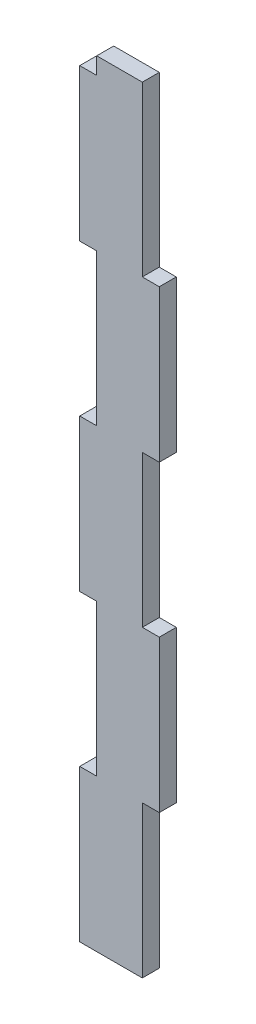
ISO-10303-21;
HEADER;
FILE_DESCRIPTION(('STEP AP214'),'2;1');
FILE_NAME('part.step','',(''),(''),'','','');
FILE_SCHEMA(('AUTOMOTIVE_DESIGN { 1 0 10303 214 1 1 1 1 }'));
ENDSEC;
DATA;
#1=APPLICATION_CONTEXT('core data for automotive mechanical design processes');
#2=APPLICATION_PROTOCOL_DEFINITION('international standard','automotive_design',2000,#1);
#3=PRODUCT_CONTEXT('',#1,'mechanical');
#4=PRODUCT('Part','Part','',(#3));
#5=PRODUCT_RELATED_PRODUCT_CATEGORY('part','',(#4));
#6=PRODUCT_DEFINITION_FORMATION('','',#4);
#7=PRODUCT_DEFINITION_CONTEXT('part definition',#1,'design');
#8=PRODUCT_DEFINITION('design','',#6,#7);
#9=PRODUCT_DEFINITION_SHAPE('','',#8);
#10=(LENGTH_UNIT() NAMED_UNIT(*) SI_UNIT(.MILLI.,.METRE.));
#11=(NAMED_UNIT(*) PLANE_ANGLE_UNIT() SI_UNIT($,.RADIAN.));
#12=(NAMED_UNIT(*) SI_UNIT($,.STERADIAN.) SOLID_ANGLE_UNIT());
#13=UNCERTAINTY_MEASURE_WITH_UNIT(LENGTH_MEASURE(1.E-05),#10,'distance_accuracy_value','');
#14=(GEOMETRIC_REPRESENTATION_CONTEXT(3) GLOBAL_UNCERTAINTY_ASSIGNED_CONTEXT((#13)) GLOBAL_UNIT_ASSIGNED_CONTEXT((#10,
#11,#12)) REPRESENTATION_CONTEXT('',''));
#15=CARTESIAN_POINT('',(0.,0.,0.));
#16=DIRECTION('',(0.,0.,1.));
#17=DIRECTION('',(1.,0.,0.));
#18=AXIS2_PLACEMENT_3D('',#15,#16,#17);
#19=CARTESIAN_POINT('',(-224.837742108433,-8.5269153254357,-248.100277417976));
#20=DIRECTION('',(0.,1.,0.));
#21=DIRECTION('',(0.,0.,1.));
#22=AXIS2_PLACEMENT_3D('',#19,#20,#21);
#23=PLANE('',#22);
#24=DIRECTION('',(1.,0.,0.));
#25=VECTOR('',#24,1.);
#26=CARTESIAN_POINT('',(-224.837742108433,-8.5269153254357,0.));
#27=LINE('',#26,#25);
#28=CARTESIAN_POINT('',(-239.344022108433,-8.5269153254357,0.));
#29=VERTEX_POINT('',#28);
#30=CARTESIAN_POINT('',(-224.837742108433,-8.5269153254357,0.));
#31=VERTEX_POINT('',#30);
#32=EDGE_CURVE('E50',#29,#31,#27,.T.);
#33=ORIENTED_EDGE('',*,*,#32,.F.);
#34=DIRECTION('',(0.,0.,1.));
#35=VECTOR('',#34,1.);
#36=CARTESIAN_POINT('',(-239.344022108433,-8.5269153254357,-248.100277417976));
#37=LINE('',#36,#35);
#38=CARTESIAN_POINT('',(-239.344022108433,-8.5269153254357,5.4));
#39=VERTEX_POINT('',#38);
#40=EDGE_CURVE('E189',#29,#39,#37,.T.);
#41=ORIENTED_EDGE('',*,*,#40,.T.);
#42=DIRECTION('',(-1.,0.,0.));
#43=VECTOR('',#42,1.);
#44=CARTESIAN_POINT('',(-224.837742108433,-8.5269153254357,5.4));
#45=LINE('',#44,#43);
#46=CARTESIAN_POINT('',(-224.837742108433,-8.5269153254357,5.4));
#47=VERTEX_POINT('',#46);
#48=EDGE_CURVE('E193',#47,#39,#45,.T.);
#49=ORIENTED_EDGE('',*,*,#48,.F.);
#50=DIRECTION('',(0.,0.,1.));
#51=VECTOR('',#50,1.);
#52=CARTESIAN_POINT('',(-224.837742108433,-8.5269153254357,-248.100277417976));
#53=LINE('',#52,#51);
#54=EDGE_CURVE('E293',#31,#47,#53,.T.);
#55=ORIENTED_EDGE('',*,*,#54,.F.);
#56=EDGE_LOOP('',(#33,#41,#49,#55));
#57=FACE_BOUND('',#56,.T.);
#58=ADVANCED_FACE('F41',(#57),#23,.T.);
#59=CARTESIAN_POINT('',(-224.837742108433,-62.1919153254357,-248.100277417976));
#60=DIRECTION('',(1.,0.,0.));
#61=DIRECTION('',(0.,1.,0.));
#62=AXIS2_PLACEMENT_3D('',#59,#60,#61);
#63=PLANE('',#62);
#64=DIRECTION('',(0.,-1.,0.));
#65=VECTOR('',#64,1.);
#66=CARTESIAN_POINT('',(-224.837742108433,-62.1919153254357,0.));
#67=LINE('',#66,#65);
#68=CARTESIAN_POINT('',(-224.837742108433,-62.1919153254357,0.));
#69=VERTEX_POINT('',#68);
#70=EDGE_CURVE('E409',#31,#69,#67,.T.);
#71=ORIENTED_EDGE('',*,*,#70,.F.);
#72=ORIENTED_EDGE('',*,*,#54,.T.);
#73=DIRECTION('',(0.,1.,0.));
#74=VECTOR('',#73,1.);
#75=CARTESIAN_POINT('',(-224.837742108433,-62.1919153254357,5.4));
#76=LINE('',#75,#74);
#77=CARTESIAN_POINT('',(-224.837742108433,-62.1919153254357,5.4));
#78=VERTEX_POINT('',#77);
#79=EDGE_CURVE('E199',#78,#47,#76,.T.);
#80=ORIENTED_EDGE('',*,*,#79,.F.);
#81=DIRECTION('',(0.,0.,1.));
#82=VECTOR('',#81,1.);
#83=CARTESIAN_POINT('',(-224.837742108433,-62.1919153254357,-248.100277417976));
#84=LINE('',#83,#82);
#85=EDGE_CURVE('E297',#69,#78,#84,.T.);
#86=ORIENTED_EDGE('',*,*,#85,.F.);
#87=EDGE_LOOP('',(#71,#72,#80,#86));
#88=FACE_BOUND('',#87,.T.);
#89=ADVANCED_FACE('F416',(#88),#63,.T.);
#90=CARTESIAN_POINT('',(-219.437742108433,-62.1919153254357,-248.100277417976));
#91=DIRECTION('',(0.,1.,0.));
#92=DIRECTION('',(0.,0.,1.));
#93=AXIS2_PLACEMENT_3D('',#90,#91,#92);
#94=PLANE('',#93);
#95=DIRECTION('',(1.,0.,0.));
#96=VECTOR('',#95,1.);
#97=CARTESIAN_POINT('',(-219.437742108433,-62.1919153254357,0.));
#98=LINE('',#97,#96);
#99=CARTESIAN_POINT('',(-219.437742108433,-62.1919153254357,0.));
#100=VERTEX_POINT('',#99);
#101=EDGE_CURVE('E406',#69,#100,#98,.T.);
#102=ORIENTED_EDGE('',*,*,#101,.F.);
#103=ORIENTED_EDGE('',*,*,#85,.T.);
#104=DIRECTION('',(-1.,0.,0.));
#105=VECTOR('',#104,1.);
#106=CARTESIAN_POINT('',(-219.437742108433,-62.1919153254357,5.4));
#107=LINE('',#106,#105);
#108=CARTESIAN_POINT('',(-219.437742108433,-62.1919153254357,5.4));
#109=VERTEX_POINT('',#108);
#110=EDGE_CURVE('E288',#109,#78,#107,.T.);
#111=ORIENTED_EDGE('',*,*,#110,.F.);
#112=DIRECTION('',(0.,0.,1.));
#113=VECTOR('',#112,1.);
#114=CARTESIAN_POINT('',(-219.437742108433,-62.1919153254357,-248.100277417976));
#115=LINE('',#114,#113);
#116=EDGE_CURVE('E300',#100,#109,#115,.T.);
#117=ORIENTED_EDGE('',*,*,#116,.F.);
#118=EDGE_LOOP('',(#102,#103,#111,#117));
#119=FACE_BOUND('',#118,.T.);
#120=ADVANCED_FACE('F419',(#119),#94,.T.);
#121=CARTESIAN_POINT('',(-219.437742108433,-110.538195325436,-248.100277417976));
#122=DIRECTION('',(1.,0.,0.));
#123=DIRECTION('',(0.,0.,-1.));
#124=AXIS2_PLACEMENT_3D('',#121,#122,#123);
#125=PLANE('',#124);
#126=DIRECTION('',(0.,-1.,0.));
#127=VECTOR('',#126,1.);
#128=CARTESIAN_POINT('',(-219.437742108433,-110.538195325436,0.));
#129=LINE('',#128,#127);
#130=CARTESIAN_POINT('',(-219.437742108433,-110.538195325436,0.));
#131=VERTEX_POINT('',#130);
#132=EDGE_CURVE('E403',#100,#131,#129,.T.);
#133=ORIENTED_EDGE('',*,*,#132,.F.);
#134=ORIENTED_EDGE('',*,*,#116,.T.);
#135=DIRECTION('',(0.,1.,0.));
#136=VECTOR('',#135,1.);
#137=CARTESIAN_POINT('',(-219.437742108433,-110.538195325436,5.4));
#138=LINE('',#137,#136);
#139=CARTESIAN_POINT('',(-219.437742108433,-110.538195325436,5.4));
#140=VERTEX_POINT('',#139);
#141=EDGE_CURVE('E284',#140,#109,#138,.T.);
#142=ORIENTED_EDGE('',*,*,#141,.F.);
#143=DIRECTION('',(0.,0.,1.));
#144=VECTOR('',#143,1.);
#145=CARTESIAN_POINT('',(-219.437742108433,-110.538195325436,-248.100277417976));
#146=LINE('',#145,#144);
#147=EDGE_CURVE('E303',#131,#140,#146,.T.);
#148=ORIENTED_EDGE('',*,*,#147,.F.);
#149=EDGE_LOOP('',(#133,#134,#142,#148));
#150=FACE_BOUND('',#149,.T.);
#151=ADVANCED_FACE('F426',(#150),#125,.T.);
#152=CARTESIAN_POINT('',(-224.837742108433,-110.538195325436,-248.100277417976));
#153=DIRECTION('',(0.,-1.,0.));
#154=DIRECTION('',(1.,0.,0.));
#155=AXIS2_PLACEMENT_3D('',#152,#153,#154);
#156=PLANE('',#155);
#157=DIRECTION('',(-1.,0.,0.));
#158=VECTOR('',#157,1.);
#159=CARTESIAN_POINT('',(-224.837742108433,-110.538195325436,0.));
#160=LINE('',#159,#158);
#161=CARTESIAN_POINT('',(-224.837742108433,-110.538195325436,0.));
#162=VERTEX_POINT('',#161);
#163=EDGE_CURVE('E400',#131,#162,#160,.T.);
#164=ORIENTED_EDGE('',*,*,#163,.F.);
#165=ORIENTED_EDGE('',*,*,#147,.T.);
#166=DIRECTION('',(1.,0.,0.));
#167=VECTOR('',#166,1.);
#168=CARTESIAN_POINT('',(-224.837742108433,-110.538195325436,5.4));
#169=LINE('',#168,#167);
#170=CARTESIAN_POINT('',(-224.837742108433,-110.538195325436,5.4));
#171=VERTEX_POINT('',#170);
#172=EDGE_CURVE('E280',#171,#140,#169,.T.);
#173=ORIENTED_EDGE('',*,*,#172,.F.);
#174=DIRECTION('',(0.,0.,1.));
#175=VECTOR('',#174,1.);
#176=CARTESIAN_POINT('',(-224.837742108433,-110.538195325436,-248.100277417976));
#177=LINE('',#176,#175);
#178=EDGE_CURVE('E306',#162,#171,#177,.T.);
#179=ORIENTED_EDGE('',*,*,#178,.F.);
#180=EDGE_LOOP('',(#164,#165,#173,#179));
#181=FACE_BOUND('',#180,.T.);
#182=ADVANCED_FACE('F431',(#181),#156,.T.);
#183=CARTESIAN_POINT('',(-224.837742108433,-158.721915325436,-248.100277417976));
#184=DIRECTION('',(1.,0.,0.));
#185=DIRECTION('',(0.,0.,-1.));
#186=AXIS2_PLACEMENT_3D('',#183,#184,#185);
#187=PLANE('',#186);
#188=DIRECTION('',(0.,-1.,0.));
#189=VECTOR('',#188,1.);
#190=CARTESIAN_POINT('',(-224.837742108433,-158.721915325436,0.));
#191=LINE('',#190,#189);
#192=CARTESIAN_POINT('',(-224.837742108433,-158.721915325436,0.));
#193=VERTEX_POINT('',#192);
#194=EDGE_CURVE('E397',#162,#193,#191,.T.);
#195=ORIENTED_EDGE('',*,*,#194,.F.);
#196=ORIENTED_EDGE('',*,*,#178,.T.);
#197=DIRECTION('',(0.,1.,0.));
#198=VECTOR('',#197,1.);
#199=CARTESIAN_POINT('',(-224.837742108433,-158.721915325436,5.4));
#200=LINE('',#199,#198);
#201=CARTESIAN_POINT('',(-224.837742108433,-158.721915325436,5.4));
#202=VERTEX_POINT('',#201);
#203=EDGE_CURVE('E276',#202,#171,#200,.T.);
#204=ORIENTED_EDGE('',*,*,#203,.F.);
#205=DIRECTION('',(0.,0.,1.));
#206=VECTOR('',#205,1.);
#207=CARTESIAN_POINT('',(-224.837742108433,-158.721915325436,-248.100277417976));
#208=LINE('',#207,#206);
#209=EDGE_CURVE('E309',#193,#202,#208,.T.);
#210=ORIENTED_EDGE('',*,*,#209,.F.);
#211=EDGE_LOOP('',(#195,#196,#204,#210));
#212=FACE_BOUND('',#211,.T.);
#213=ADVANCED_FACE('F434',(#212),#187,.T.);
#214=CARTESIAN_POINT('',(-219.437742108432,-158.721915325436,-248.100277417976));
#215=DIRECTION('',(0.,1.,0.));
#216=DIRECTION('',(0.,0.,1.));
#217=AXIS2_PLACEMENT_3D('',#214,#215,#216);
#218=PLANE('',#217);
#219=DIRECTION('',(1.,0.,0.));
#220=VECTOR('',#219,1.);
#221=CARTESIAN_POINT('',(-219.437742108432,-158.721915325436,0.));
#222=LINE('',#221,#220);
#223=CARTESIAN_POINT('',(-219.437742108432,-158.721915325436,0.));
#224=VERTEX_POINT('',#223);
#225=EDGE_CURVE('E394',#193,#224,#222,.T.);
#226=ORIENTED_EDGE('',*,*,#225,.F.);
#227=ORIENTED_EDGE('',*,*,#209,.T.);
#228=DIRECTION('',(-1.,0.,0.));
#229=VECTOR('',#228,1.);
#230=CARTESIAN_POINT('',(-219.437742108432,-158.721915325436,5.4));
#231=LINE('',#230,#229);
#232=CARTESIAN_POINT('',(-219.437742108432,-158.721915325436,5.4));
#233=VERTEX_POINT('',#232);
#234=EDGE_CURVE('E272',#233,#202,#231,.T.);
#235=ORIENTED_EDGE('',*,*,#234,.F.);
#236=DIRECTION('',(0.,0.,1.));
#237=VECTOR('',#236,1.);
#238=CARTESIAN_POINT('',(-219.437742108432,-158.721915325436,-248.100277417976));
#239=LINE('',#238,#237);
#240=EDGE_CURVE('E312',#224,#233,#239,.T.);
#241=ORIENTED_EDGE('',*,*,#240,.F.);
#242=EDGE_LOOP('',(#226,#227,#235,#241));
#243=FACE_BOUND('',#242,.T.);
#244=ADVANCED_FACE('F440',(#243),#218,.T.);
#245=CARTESIAN_POINT('',(-219.437742108432,-207.068195325436,-248.100277417976));
#246=DIRECTION('',(1.,0.,0.));
#247=DIRECTION('',(0.,0.,-1.));
#248=AXIS2_PLACEMENT_3D('',#245,#246,#247);
#249=PLANE('',#248);
#250=DIRECTION('',(0.,-1.,0.));
#251=VECTOR('',#250,1.);
#252=CARTESIAN_POINT('',(-219.437742108432,-207.068195325436,0.));
#253=LINE('',#252,#251);
#254=CARTESIAN_POINT('',(-219.437742108432,-207.068195325436,0.));
#255=VERTEX_POINT('',#254);
#256=EDGE_CURVE('E391',#224,#255,#253,.T.);
#257=ORIENTED_EDGE('',*,*,#256,.F.);
#258=ORIENTED_EDGE('',*,*,#240,.T.);
#259=DIRECTION('',(0.,1.,0.));
#260=VECTOR('',#259,1.);
#261=CARTESIAN_POINT('',(-219.437742108432,-207.068195325436,5.4));
#262=LINE('',#261,#260);
#263=CARTESIAN_POINT('',(-219.437742108432,-207.068195325436,5.4));
#264=VERTEX_POINT('',#263);
#265=EDGE_CURVE('E268',#264,#233,#262,.T.);
#266=ORIENTED_EDGE('',*,*,#265,.F.);
#267=DIRECTION('',(0.,0.,1.));
#268=VECTOR('',#267,1.);
#269=CARTESIAN_POINT('',(-219.437742108432,-207.068195325436,-248.100277417976));
#270=LINE('',#269,#268);
#271=EDGE_CURVE('E315',#255,#264,#270,.T.);
#272=ORIENTED_EDGE('',*,*,#271,.F.);
#273=EDGE_LOOP('',(#257,#258,#266,#272));
#274=FACE_BOUND('',#273,.T.);
#275=ADVANCED_FACE('F444',(#274),#249,.T.);
#276=CARTESIAN_POINT('',(-224.837742108433,-207.068195325436,-248.100277417976));
#277=DIRECTION('',(0.,-1.,0.));
#278=DIRECTION('',(0.,0.,-1.));
#279=AXIS2_PLACEMENT_3D('',#276,#277,#278);
#280=PLANE('',#279);
#281=DIRECTION('',(-1.,0.,0.));
#282=VECTOR('',#281,1.);
#283=CARTESIAN_POINT('',(-224.837742108433,-207.068195325436,0.));
#284=LINE('',#283,#282);
#285=CARTESIAN_POINT('',(-224.837742108433,-207.068195325436,0.));
#286=VERTEX_POINT('',#285);
#287=EDGE_CURVE('E388',#255,#286,#284,.T.);
#288=ORIENTED_EDGE('',*,*,#287,.F.);
#289=ORIENTED_EDGE('',*,*,#271,.T.);
#290=DIRECTION('',(1.,0.,0.));
#291=VECTOR('',#290,1.);
#292=CARTESIAN_POINT('',(-224.837742108433,-207.068195325436,5.4));
#293=LINE('',#292,#291);
#294=CARTESIAN_POINT('',(-224.837742108433,-207.068195325436,5.4));
#295=VERTEX_POINT('',#294);
#296=EDGE_CURVE('E264',#295,#264,#293,.T.);
#297=ORIENTED_EDGE('',*,*,#296,.F.);
#298=DIRECTION('',(0.,0.,1.));
#299=VECTOR('',#298,1.);
#300=CARTESIAN_POINT('',(-224.837742108433,-207.068195325436,-248.100277417976));
#301=LINE('',#300,#299);
#302=EDGE_CURVE('E318',#286,#295,#301,.T.);
#303=ORIENTED_EDGE('',*,*,#302,.F.);
#304=EDGE_LOOP('',(#288,#289,#297,#303));
#305=FACE_BOUND('',#304,.T.);
#306=ADVANCED_FACE('F450',(#305),#280,.T.);
#307=CARTESIAN_POINT('',(-224.837742108433,-255.333195325436,-248.100277417976));
#308=DIRECTION('',(1.,0.,0.));
#309=DIRECTION('',(0.,0.,-1.));
#310=AXIS2_PLACEMENT_3D('',#307,#308,#309);
#311=PLANE('',#310);
#312=DIRECTION('',(0.,-1.,0.));
#313=VECTOR('',#312,1.);
#314=CARTESIAN_POINT('',(-224.837742108433,-255.333195325436,0.));
#315=LINE('',#314,#313);
#316=CARTESIAN_POINT('',(-224.837742108433,-255.333195325436,0.));
#317=VERTEX_POINT('',#316);
#318=EDGE_CURVE('E385',#286,#317,#315,.T.);
#319=ORIENTED_EDGE('',*,*,#318,.F.);
#320=ORIENTED_EDGE('',*,*,#302,.T.);
#321=DIRECTION('',(0.,1.,0.));
#322=VECTOR('',#321,1.);
#323=CARTESIAN_POINT('',(-224.837742108433,-255.333195325436,5.4));
#324=LINE('',#323,#322);
#325=CARTESIAN_POINT('',(-224.837742108433,-255.333195325436,5.4));
#326=VERTEX_POINT('',#325);
#327=EDGE_CURVE('E260',#326,#295,#324,.T.);
#328=ORIENTED_EDGE('',*,*,#327,.F.);
#329=DIRECTION('',(0.,0.,1.));
#330=VECTOR('',#329,1.);
#331=CARTESIAN_POINT('',(-224.837742108433,-255.333195325436,-248.100277417976));
#332=LINE('',#331,#330);
#333=EDGE_CURVE('E321',#317,#326,#332,.T.);
#334=ORIENTED_EDGE('',*,*,#333,.F.);
#335=EDGE_LOOP('',(#319,#320,#328,#334));
#336=FACE_BOUND('',#335,.T.);
#337=ADVANCED_FACE('F454',(#336),#311,.T.);
#338=CARTESIAN_POINT('',(-244.744022108431,-255.333195325436,-248.100277417976));
#339=DIRECTION('',(0.,-1.,0.));
#340=DIRECTION('',(0.,0.,-1.));
#341=AXIS2_PLACEMENT_3D('',#338,#339,#340);
#342=PLANE('',#341);
#343=DIRECTION('',(-1.,0.,0.));
#344=VECTOR('',#343,1.);
#345=CARTESIAN_POINT('',(-244.744022108431,-255.333195325436,0.));
#346=LINE('',#345,#344);
#347=CARTESIAN_POINT('',(-244.744022108431,-255.333195325436,0.));
#348=VERTEX_POINT('',#347);
#349=EDGE_CURVE('E382',#317,#348,#346,.T.);
#350=ORIENTED_EDGE('',*,*,#349,.F.);
#351=ORIENTED_EDGE('',*,*,#333,.T.);
#352=DIRECTION('',(1.,0.,0.));
#353=VECTOR('',#352,1.);
#354=CARTESIAN_POINT('',(-244.744022108431,-255.333195325436,5.4));
#355=LINE('',#354,#353);
#356=CARTESIAN_POINT('',(-244.744022108431,-255.333195325436,5.4));
#357=VERTEX_POINT('',#356);
#358=EDGE_CURVE('E256',#357,#326,#355,.T.);
#359=ORIENTED_EDGE('',*,*,#358,.F.);
#360=DIRECTION('',(0.,0.,1.));
#361=VECTOR('',#360,1.);
#362=CARTESIAN_POINT('',(-244.744022108431,-255.333195325436,-248.100277417976));
#363=LINE('',#362,#361);
#364=EDGE_CURVE('E324',#348,#357,#363,.T.);
#365=ORIENTED_EDGE('',*,*,#364,.F.);
#366=EDGE_LOOP('',(#350,#351,#359,#365));
#367=FACE_BOUND('',#366,.T.);
#368=ADVANCED_FACE('F460',(#367),#342,.T.);
#369=CARTESIAN_POINT('',(-244.744022108431,-206.986915325436,-248.100277417976));
#370=DIRECTION('',(-1.,0.,0.));
#371=DIRECTION('',(0.,-1.,0.));
#372=AXIS2_PLACEMENT_3D('',#369,#370,#371);
#373=PLANE('',#372);
#374=DIRECTION('',(0.,1.,0.));
#375=VECTOR('',#374,1.);
#376=CARTESIAN_POINT('',(-244.744022108431,-206.986915325436,0.));
#377=LINE('',#376,#375);
#378=CARTESIAN_POINT('',(-244.744022108431,-206.986915325436,0.));
#379=VERTEX_POINT('',#378);
#380=EDGE_CURVE('E379',#348,#379,#377,.T.);
#381=ORIENTED_EDGE('',*,*,#380,.F.);
#382=ORIENTED_EDGE('',*,*,#364,.T.);
#383=DIRECTION('',(0.,-1.,0.));
#384=VECTOR('',#383,1.);
#385=CARTESIAN_POINT('',(-244.744022108431,-206.986915325436,5.4));
#386=LINE('',#385,#384);
#387=CARTESIAN_POINT('',(-244.744022108431,-206.986915325436,5.4));
#388=VERTEX_POINT('',#387);
#389=EDGE_CURVE('E252',#388,#357,#386,.T.);
#390=ORIENTED_EDGE('',*,*,#389,.F.);
#391=DIRECTION('',(0.,0.,1.));
#392=VECTOR('',#391,1.);
#393=CARTESIAN_POINT('',(-244.744022108431,-206.986915325436,-248.100277417976));
#394=LINE('',#393,#392);
#395=EDGE_CURVE('E327',#379,#388,#394,.T.);
#396=ORIENTED_EDGE('',*,*,#395,.F.);
#397=EDGE_LOOP('',(#381,#382,#390,#396));
#398=FACE_BOUND('',#397,.T.);
#399=ADVANCED_FACE('F464',(#398),#373,.T.);
#400=CARTESIAN_POINT('',(-239.344022108433,-206.986915325436,-248.100277417976));
#401=DIRECTION('',(0.,1.,0.));
#402=DIRECTION('',(0.,0.,1.));
#403=AXIS2_PLACEMENT_3D('',#400,#401,#402);
#404=PLANE('',#403);
#405=DIRECTION('',(1.,0.,0.));
#406=VECTOR('',#405,1.);
#407=CARTESIAN_POINT('',(-239.344022108433,-206.986915325436,0.));
#408=LINE('',#407,#406);
#409=CARTESIAN_POINT('',(-239.344022108433,-206.986915325436,0.));
#410=VERTEX_POINT('',#409);
#411=EDGE_CURVE('E376',#379,#410,#408,.T.);
#412=ORIENTED_EDGE('',*,*,#411,.F.);
#413=ORIENTED_EDGE('',*,*,#395,.T.);
#414=DIRECTION('',(-1.,0.,0.));
#415=VECTOR('',#414,1.);
#416=CARTESIAN_POINT('',(-239.344022108433,-206.986915325436,5.4));
#417=LINE('',#416,#415);
#418=CARTESIAN_POINT('',(-239.344022108433,-206.986915325436,5.4));
#419=VERTEX_POINT('',#418);
#420=EDGE_CURVE('E248',#419,#388,#417,.T.);
#421=ORIENTED_EDGE('',*,*,#420,.F.);
#422=DIRECTION('',(0.,0.,1.));
#423=VECTOR('',#422,1.);
#424=CARTESIAN_POINT('',(-239.344022108433,-206.986915325436,-248.100277417976));
#425=LINE('',#424,#423);
#426=EDGE_CURVE('E330',#410,#419,#425,.T.);
#427=ORIENTED_EDGE('',*,*,#426,.F.);
#428=EDGE_LOOP('',(#412,#413,#421,#427));
#429=FACE_BOUND('',#428,.T.);
#430=ADVANCED_FACE('F470',(#429),#404,.T.);
#431=CARTESIAN_POINT('',(-239.344022108433,-158.803195325436,-248.100277417976));
#432=DIRECTION('',(-1.,0.,0.));
#433=DIRECTION('',(0.,0.,1.));
#434=AXIS2_PLACEMENT_3D('',#431,#432,#433);
#435=PLANE('',#434);
#436=DIRECTION('',(0.,1.,0.));
#437=VECTOR('',#436,1.);
#438=CARTESIAN_POINT('',(-239.344022108433,-158.803195325436,0.));
#439=LINE('',#438,#437);
#440=CARTESIAN_POINT('',(-239.344022108433,-158.803195325436,0.));
#441=VERTEX_POINT('',#440);
#442=EDGE_CURVE('E373',#410,#441,#439,.T.);
#443=ORIENTED_EDGE('',*,*,#442,.F.);
#444=ORIENTED_EDGE('',*,*,#426,.T.);
#445=DIRECTION('',(0.,-1.,0.));
#446=VECTOR('',#445,1.);
#447=CARTESIAN_POINT('',(-239.344022108433,-158.803195325436,5.4));
#448=LINE('',#447,#446);
#449=CARTESIAN_POINT('',(-239.344022108433,-158.803195325436,5.4));
#450=VERTEX_POINT('',#449);
#451=EDGE_CURVE('E244',#450,#419,#448,.T.);
#452=ORIENTED_EDGE('',*,*,#451,.F.);
#453=DIRECTION('',(0.,0.,1.));
#454=VECTOR('',#453,1.);
#455=CARTESIAN_POINT('',(-239.344022108433,-158.803195325436,-248.100277417976));
#456=LINE('',#455,#454);
#457=EDGE_CURVE('E333',#441,#450,#456,.T.);
#458=ORIENTED_EDGE('',*,*,#457,.F.);
#459=EDGE_LOOP('',(#443,#444,#452,#458));
#460=FACE_BOUND('',#459,.T.);
#461=ADVANCED_FACE('F474',(#460),#435,.T.);
#462=CARTESIAN_POINT('',(-244.744022108432,-158.803195325436,-248.100277417976));
#463=DIRECTION('',(0.,-1.,0.));
#464=DIRECTION('',(0.,0.,-1.));
#465=AXIS2_PLACEMENT_3D('',#462,#463,#464);
#466=PLANE('',#465);
#467=DIRECTION('',(-1.,0.,0.));
#468=VECTOR('',#467,1.);
#469=CARTESIAN_POINT('',(-244.744022108432,-158.803195325436,0.));
#470=LINE('',#469,#468);
#471=CARTESIAN_POINT('',(-244.744022108432,-158.803195325436,0.));
#472=VERTEX_POINT('',#471);
#473=EDGE_CURVE('E370',#441,#472,#470,.T.);
#474=ORIENTED_EDGE('',*,*,#473,.F.);
#475=ORIENTED_EDGE('',*,*,#457,.T.);
#476=DIRECTION('',(1.,0.,0.));
#477=VECTOR('',#476,1.);
#478=CARTESIAN_POINT('',(-244.744022108432,-158.803195325436,5.4));
#479=LINE('',#478,#477);
#480=CARTESIAN_POINT('',(-244.744022108432,-158.803195325436,5.4));
#481=VERTEX_POINT('',#480);
#482=EDGE_CURVE('E240',#481,#450,#479,.T.);
#483=ORIENTED_EDGE('',*,*,#482,.F.);
#484=DIRECTION('',(0.,0.,1.));
#485=VECTOR('',#484,1.);
#486=CARTESIAN_POINT('',(-244.744022108432,-158.803195325436,-248.100277417976));
#487=LINE('',#486,#485);
#488=EDGE_CURVE('E336',#472,#481,#487,.T.);
#489=ORIENTED_EDGE('',*,*,#488,.F.);
#490=EDGE_LOOP('',(#474,#475,#483,#489));
#491=FACE_BOUND('',#490,.T.);
#492=ADVANCED_FACE('F480',(#491),#466,.T.);
#493=CARTESIAN_POINT('',(-244.744022108432,-110.456915325436,-248.100277417976));
#494=DIRECTION('',(-1.,0.,0.));
#495=DIRECTION('',(0.,-1.,0.));
#496=AXIS2_PLACEMENT_3D('',#493,#494,#495);
#497=PLANE('',#496);
#498=DIRECTION('',(0.,1.,0.));
#499=VECTOR('',#498,1.);
#500=CARTESIAN_POINT('',(-244.744022108432,-110.456915325436,0.));
#501=LINE('',#500,#499);
#502=CARTESIAN_POINT('',(-244.744022108432,-110.456915325436,0.));
#503=VERTEX_POINT('',#502);
#504=EDGE_CURVE('E367',#472,#503,#501,.T.);
#505=ORIENTED_EDGE('',*,*,#504,.F.);
#506=ORIENTED_EDGE('',*,*,#488,.T.);
#507=DIRECTION('',(0.,-1.,0.));
#508=VECTOR('',#507,1.);
#509=CARTESIAN_POINT('',(-244.744022108432,-110.456915325436,5.4));
#510=LINE('',#509,#508);
#511=CARTESIAN_POINT('',(-244.744022108432,-110.456915325436,5.4));
#512=VERTEX_POINT('',#511);
#513=EDGE_CURVE('E236',#512,#481,#510,.T.);
#514=ORIENTED_EDGE('',*,*,#513,.F.);
#515=DIRECTION('',(0.,0.,1.));
#516=VECTOR('',#515,1.);
#517=CARTESIAN_POINT('',(-244.744022108432,-110.456915325436,-248.100277417976));
#518=LINE('',#517,#516);
#519=EDGE_CURVE('E339',#503,#512,#518,.T.);
#520=ORIENTED_EDGE('',*,*,#519,.F.);
#521=EDGE_LOOP('',(#505,#506,#514,#520));
#522=FACE_BOUND('',#521,.T.);
#523=ADVANCED_FACE('F484',(#522),#497,.T.);
#524=CARTESIAN_POINT('',(-239.344022108433,-110.456915325436,-248.100277417976));
#525=DIRECTION('',(0.,1.,0.));
#526=DIRECTION('',(0.,0.,1.));
#527=AXIS2_PLACEMENT_3D('',#524,#525,#526);
#528=PLANE('',#527);
#529=DIRECTION('',(1.,0.,0.));
#530=VECTOR('',#529,1.);
#531=CARTESIAN_POINT('',(-239.344022108433,-110.456915325436,0.));
#532=LINE('',#531,#530);
#533=CARTESIAN_POINT('',(-239.344022108433,-110.456915325436,0.));
#534=VERTEX_POINT('',#533);
#535=EDGE_CURVE('E364',#503,#534,#532,.T.);
#536=ORIENTED_EDGE('',*,*,#535,.F.);
#537=ORIENTED_EDGE('',*,*,#519,.T.);
#538=DIRECTION('',(-1.,0.,0.));
#539=VECTOR('',#538,1.);
#540=CARTESIAN_POINT('',(-239.344022108433,-110.456915325436,5.4));
#541=LINE('',#540,#539);
#542=CARTESIAN_POINT('',(-239.344022108433,-110.456915325436,5.4));
#543=VERTEX_POINT('',#542);
#544=EDGE_CURVE('E232',#543,#512,#541,.T.);
#545=ORIENTED_EDGE('',*,*,#544,.F.);
#546=DIRECTION('',(0.,0.,1.));
#547=VECTOR('',#546,1.);
#548=CARTESIAN_POINT('',(-239.344022108433,-110.456915325436,-248.100277417976));
#549=LINE('',#548,#547);
#550=EDGE_CURVE('E342',#534,#543,#549,.T.);
#551=ORIENTED_EDGE('',*,*,#550,.F.);
#552=EDGE_LOOP('',(#536,#537,#545,#551));
#553=FACE_BOUND('',#552,.T.);
#554=ADVANCED_FACE('F490',(#553),#528,.T.);
#555=CARTESIAN_POINT('',(-239.344022108433,-62.2731953254357,-248.100277417976));
#556=DIRECTION('',(-1.,0.,0.));
#557=DIRECTION('',(0.,0.,1.));
#558=AXIS2_PLACEMENT_3D('',#555,#556,#557);
#559=PLANE('',#558);
#560=DIRECTION('',(0.,1.,0.));
#561=VECTOR('',#560,1.);
#562=CARTESIAN_POINT('',(-239.344022108433,-62.2731953254357,0.));
#563=LINE('',#562,#561);
#564=CARTESIAN_POINT('',(-239.344022108433,-62.2731953254357,0.));
#565=VERTEX_POINT('',#564);
#566=EDGE_CURVE('E361',#534,#565,#563,.T.);
#567=ORIENTED_EDGE('',*,*,#566,.F.);
#568=ORIENTED_EDGE('',*,*,#550,.T.);
#569=DIRECTION('',(0.,-1.,0.));
#570=VECTOR('',#569,1.);
#571=CARTESIAN_POINT('',(-239.344022108433,-62.2731953254357,5.4));
#572=LINE('',#571,#570);
#573=CARTESIAN_POINT('',(-239.344022108433,-62.2731953254357,5.4));
#574=VERTEX_POINT('',#573);
#575=EDGE_CURVE('E228',#574,#543,#572,.T.);
#576=ORIENTED_EDGE('',*,*,#575,.F.);
#577=DIRECTION('',(0.,0.,1.));
#578=VECTOR('',#577,1.);
#579=CARTESIAN_POINT('',(-239.344022108433,-62.2731953254357,-248.100277417976));
#580=LINE('',#579,#578);
#581=EDGE_CURVE('E345',#565,#574,#580,.T.);
#582=ORIENTED_EDGE('',*,*,#581,.F.);
#583=EDGE_LOOP('',(#567,#568,#576,#582));
#584=FACE_BOUND('',#583,.T.);
#585=ADVANCED_FACE('F494',(#584),#559,.T.);
#586=CARTESIAN_POINT('',(-244.744022108433,-62.2731953254357,-248.100277417976));
#587=DIRECTION('',(0.,-1.,0.));
#588=DIRECTION('',(0.,0.,-1.));
#589=AXIS2_PLACEMENT_3D('',#586,#587,#588);
#590=PLANE('',#589);
#591=DIRECTION('',(-1.,0.,0.));
#592=VECTOR('',#591,1.);
#593=CARTESIAN_POINT('',(-244.744022108433,-62.2731953254357,0.));
#594=LINE('',#593,#592);
#595=CARTESIAN_POINT('',(-244.744022108433,-62.2731953254357,0.));
#596=VERTEX_POINT('',#595);
#597=EDGE_CURVE('E62',#565,#596,#594,.T.);
#598=ORIENTED_EDGE('',*,*,#597,.F.);
#599=ORIENTED_EDGE('',*,*,#581,.T.);
#600=DIRECTION('',(1.,0.,0.));
#601=VECTOR('',#600,1.);
#602=CARTESIAN_POINT('',(-244.744022108433,-62.2731953254357,5.4));
#603=LINE('',#602,#601);
#604=CARTESIAN_POINT('',(-244.744022108433,-62.2731953254357,5.4));
#605=VERTEX_POINT('',#604);
#606=EDGE_CURVE('E224',#605,#574,#603,.T.);
#607=ORIENTED_EDGE('',*,*,#606,.F.);
#608=DIRECTION('',(0.,0.,1.));
#609=VECTOR('',#608,1.);
#610=CARTESIAN_POINT('',(-244.744022108433,-62.2731953254357,-248.100277417976));
#611=LINE('',#610,#609);
#612=EDGE_CURVE('E348',#596,#605,#611,.T.);
#613=ORIENTED_EDGE('',*,*,#612,.F.);
#614=EDGE_LOOP('',(#598,#599,#607,#613));
#615=FACE_BOUND('',#614,.T.);
#616=ADVANCED_FACE('F498',(#615),#590,.T.);
#617=CARTESIAN_POINT('',(-244.744022108433,-13.9269153254357,-248.100277417976));
#618=DIRECTION('',(-1.,0.,0.));
#619=DIRECTION('',(0.,-1.,0.));
#620=AXIS2_PLACEMENT_3D('',#617,#618,#619);
#621=PLANE('',#620);
#622=DIRECTION('',(0.,1.,0.));
#623=VECTOR('',#622,1.);
#624=CARTESIAN_POINT('',(-244.744022108433,-13.9269153254357,0.));
#625=LINE('',#624,#623);
#626=CARTESIAN_POINT('',(-244.744022108433,-13.9269153254357,0.));
#627=VERTEX_POINT('',#626);
#628=EDGE_CURVE('E57',#596,#627,#625,.T.);
#629=ORIENTED_EDGE('',*,*,#628,.F.);
#630=ORIENTED_EDGE('',*,*,#612,.T.);
#631=DIRECTION('',(0.,-1.,0.));
#632=VECTOR('',#631,1.);
#633=CARTESIAN_POINT('',(-244.744022108433,-13.9269153254357,5.4));
#634=LINE('',#633,#632);
#635=CARTESIAN_POINT('',(-244.744022108433,-13.9269153254357,5.4));
#636=VERTEX_POINT('',#635);
#637=EDGE_CURVE('E220',#636,#605,#634,.T.);
#638=ORIENTED_EDGE('',*,*,#637,.F.);
#639=DIRECTION('',(0.,0.,1.));
#640=VECTOR('',#639,1.);
#641=CARTESIAN_POINT('',(-244.744022108433,-13.9269153254357,-248.100277417976));
#642=LINE('',#641,#640);
#643=EDGE_CURVE('E351',#627,#636,#642,.T.);
#644=ORIENTED_EDGE('',*,*,#643,.F.);
#645=EDGE_LOOP('',(#629,#630,#638,#644));
#646=FACE_BOUND('',#645,.T.);
#647=ADVANCED_FACE('F502',(#646),#621,.T.);
#648=CARTESIAN_POINT('',(-239.344022108433,-13.9269153254357,-248.100277417976));
#649=DIRECTION('',(0.,1.,0.));
#650=DIRECTION('',(0.,0.,1.));
#651=AXIS2_PLACEMENT_3D('',#648,#649,#650);
#652=PLANE('',#651);
#653=DIRECTION('',(1.,0.,0.));
#654=VECTOR('',#653,1.);
#655=CARTESIAN_POINT('',(-239.344022108433,-13.9269153254357,0.));
#656=LINE('',#655,#654);
#657=CARTESIAN_POINT('',(-239.344022108433,-13.9269153254357,0.));
#658=VERTEX_POINT('',#657);
#659=EDGE_CURVE('E296',#627,#658,#656,.T.);
#660=ORIENTED_EDGE('',*,*,#659,.F.);
#661=ORIENTED_EDGE('',*,*,#643,.T.);
#662=DIRECTION('',(-1.,0.,0.));
#663=VECTOR('',#662,1.);
#664=CARTESIAN_POINT('',(-239.344022108433,-13.9269153254357,5.4));
#665=LINE('',#664,#663);
#666=CARTESIAN_POINT('',(-239.344022108433,-13.9269153254357,5.4));
#667=VERTEX_POINT('',#666);
#668=EDGE_CURVE('E208',#667,#636,#665,.T.);
#669=ORIENTED_EDGE('',*,*,#668,.F.);
#670=DIRECTION('',(0.,0.,1.));
#671=VECTOR('',#670,1.);
#672=CARTESIAN_POINT('',(-239.344022108433,-13.9269153254357,-248.100277417976));
#673=LINE('',#672,#671);
#674=EDGE_CURVE('E198',#658,#667,#673,.T.);
#675=ORIENTED_EDGE('',*,*,#674,.F.);
#676=EDGE_LOOP('',(#660,#661,#669,#675));
#677=FACE_BOUND('',#676,.T.);
#678=ADVANCED_FACE('F505',(#677),#652,.T.);
#679=CARTESIAN_POINT('',(-239.344022108433,-8.5269153254357,-248.100277417976));
#680=DIRECTION('',(-1.,0.,0.));
#681=DIRECTION('',(0.,-1.,0.));
#682=AXIS2_PLACEMENT_3D('',#679,#680,#681);
#683=PLANE('',#682);
#684=DIRECTION('',(0.,1.,0.));
#685=VECTOR('',#684,1.);
#686=CARTESIAN_POINT('',(-239.344022108433,-8.5269153254357,0.));
#687=LINE('',#686,#685);
#688=EDGE_CURVE('E11',#658,#29,#687,.T.);
#689=ORIENTED_EDGE('',*,*,#688,.F.);
#690=ORIENTED_EDGE('',*,*,#674,.T.);
#691=DIRECTION('',(0.,-1.,0.));
#692=VECTOR('',#691,1.);
#693=CARTESIAN_POINT('',(-239.344022108433,-8.5269153254357,5.4));
#694=LINE('',#693,#692);
#695=EDGE_CURVE('E201',#39,#667,#694,.T.);
#696=ORIENTED_EDGE('',*,*,#695,.F.);
#697=ORIENTED_EDGE('',*,*,#40,.F.);
#698=EDGE_LOOP('',(#689,#690,#696,#697));
#699=FACE_BOUND('',#698,.T.);
#700=ADVANCED_FACE('F202',(#699),#683,.T.);
#701=CARTESIAN_POINT('',(0.,0.,0.));
#702=DIRECTION('',(0.,0.,1.));
#703=DIRECTION('',(1.,0.,0.));
#704=AXIS2_PLACEMENT_3D('',#701,#702,#703);
#705=PLANE('',#704);
#706=ORIENTED_EDGE('',*,*,#32,.T.);
#707=ORIENTED_EDGE('',*,*,#70,.T.);
#708=ORIENTED_EDGE('',*,*,#101,.T.);
#709=ORIENTED_EDGE('',*,*,#132,.T.);
#710=ORIENTED_EDGE('',*,*,#163,.T.);
#711=ORIENTED_EDGE('',*,*,#194,.T.);
#712=ORIENTED_EDGE('',*,*,#225,.T.);
#713=ORIENTED_EDGE('',*,*,#256,.T.);
#714=ORIENTED_EDGE('',*,*,#287,.T.);
#715=ORIENTED_EDGE('',*,*,#318,.T.);
#716=ORIENTED_EDGE('',*,*,#349,.T.);
#717=ORIENTED_EDGE('',*,*,#380,.T.);
#718=ORIENTED_EDGE('',*,*,#411,.T.);
#719=ORIENTED_EDGE('',*,*,#442,.T.);
#720=ORIENTED_EDGE('',*,*,#473,.T.);
#721=ORIENTED_EDGE('',*,*,#504,.T.);
#722=ORIENTED_EDGE('',*,*,#535,.T.);
#723=ORIENTED_EDGE('',*,*,#566,.T.);
#724=ORIENTED_EDGE('',*,*,#597,.T.);
#725=ORIENTED_EDGE('',*,*,#628,.T.);
#726=ORIENTED_EDGE('',*,*,#659,.T.);
#727=ORIENTED_EDGE('',*,*,#688,.T.);
#728=EDGE_LOOP('',(#706,#707,#708,#709,#710,#711,#712,#713,#714,#715,#716,#717,#718,#719,#720,
#721,#722,#723,#724,#725,#726,#727));
#729=FACE_BOUND('',#728,.T.);
#730=ADVANCED_FACE('F43',(#729),#705,.F.);
#731=CARTESIAN_POINT('',(0.,0.,5.4));
#732=DIRECTION('',(0.,0.,1.));
#733=DIRECTION('',(1.,0.,0.));
#734=AXIS2_PLACEMENT_3D('',#731,#732,#733);
#735=PLANE('',#734);
#736=ORIENTED_EDGE('',*,*,#48,.T.);
#737=ORIENTED_EDGE('',*,*,#695,.T.);
#738=ORIENTED_EDGE('',*,*,#668,.T.);
#739=ORIENTED_EDGE('',*,*,#637,.T.);
#740=ORIENTED_EDGE('',*,*,#606,.T.);
#741=ORIENTED_EDGE('',*,*,#575,.T.);
#742=ORIENTED_EDGE('',*,*,#544,.T.);
#743=ORIENTED_EDGE('',*,*,#513,.T.);
#744=ORIENTED_EDGE('',*,*,#482,.T.);
#745=ORIENTED_EDGE('',*,*,#451,.T.);
#746=ORIENTED_EDGE('',*,*,#420,.T.);
#747=ORIENTED_EDGE('',*,*,#389,.T.);
#748=ORIENTED_EDGE('',*,*,#358,.T.);
#749=ORIENTED_EDGE('',*,*,#327,.T.);
#750=ORIENTED_EDGE('',*,*,#296,.T.);
#751=ORIENTED_EDGE('',*,*,#265,.T.);
#752=ORIENTED_EDGE('',*,*,#234,.T.);
#753=ORIENTED_EDGE('',*,*,#203,.T.);
#754=ORIENTED_EDGE('',*,*,#172,.T.);
#755=ORIENTED_EDGE('',*,*,#141,.T.);
#756=ORIENTED_EDGE('',*,*,#110,.T.);
#757=ORIENTED_EDGE('',*,*,#79,.T.);
#758=EDGE_LOOP('',(#736,#737,#738,#739,#740,#741,#742,#743,#744,#745,#746,#747,#748,#749,#750,
#751,#752,#753,#754,#755,#756,#757));
#759=FACE_BOUND('',#758,.T.);
#760=ADVANCED_FACE('F210',(#759),#735,.T.);
#761=CLOSED_SHELL('',(#58,#89,#120,#151,#182,#213,#244,#275,#306,#337,#368,#399,#430,#461,#492,
#523,#554,#585,#616,#647,#678,#700,#730,#760));
#762=MANIFOLD_SOLID_BREP('B2',#761);
#763=ADVANCED_BREP_SHAPE_REPRESENTATION('',(#18,#762),#14);
#764=SHAPE_DEFINITION_REPRESENTATION(#9,#763);
ENDSEC;
END-ISO-10303-21;
